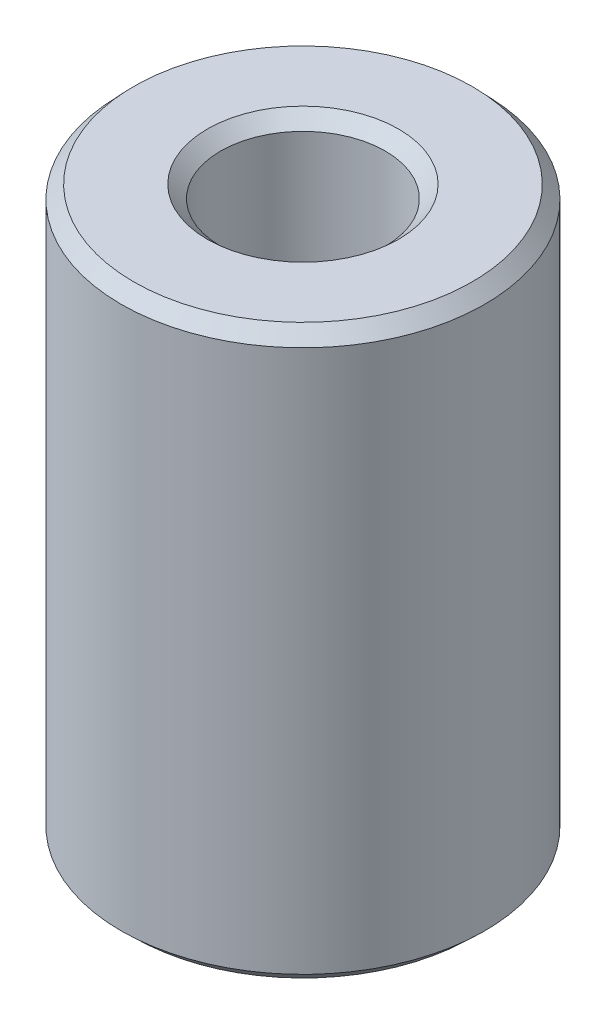
ISO-10303-21;
HEADER;
FILE_DESCRIPTION(('STEP AP214'),'2;1');
FILE_NAME('part.step','',(''),(''),'','','');
FILE_SCHEMA(('AUTOMOTIVE_DESIGN { 1 0 10303 214 1 1 1 1 }'));
ENDSEC;
DATA;
#1=APPLICATION_CONTEXT('core data for automotive mechanical design processes');
#2=APPLICATION_PROTOCOL_DEFINITION('international standard','automotive_design',2000,#1);
#3=PRODUCT_CONTEXT('',#1,'mechanical');
#4=PRODUCT('Part','Part','',(#3));
#5=PRODUCT_RELATED_PRODUCT_CATEGORY('part','',(#4));
#6=PRODUCT_DEFINITION_FORMATION('','',#4);
#7=PRODUCT_DEFINITION_CONTEXT('part definition',#1,'design');
#8=PRODUCT_DEFINITION('design','',#6,#7);
#9=PRODUCT_DEFINITION_SHAPE('','',#8);
#10=(LENGTH_UNIT() NAMED_UNIT(*) SI_UNIT(.MILLI.,.METRE.));
#11=(NAMED_UNIT(*) PLANE_ANGLE_UNIT() SI_UNIT($,.RADIAN.));
#12=(NAMED_UNIT(*) SI_UNIT($,.STERADIAN.) SOLID_ANGLE_UNIT());
#13=UNCERTAINTY_MEASURE_WITH_UNIT(LENGTH_MEASURE(1.E-05),#10,'distance_accuracy_value','');
#14=(GEOMETRIC_REPRESENTATION_CONTEXT(3) GLOBAL_UNCERTAINTY_ASSIGNED_CONTEXT((#13)) GLOBAL_UNIT_ASSIGNED_CONTEXT((#10,
#11,#12)) REPRESENTATION_CONTEXT('',''));
#15=CARTESIAN_POINT('',(0.,0.,0.));
#16=DIRECTION('',(0.,0.,1.));
#17=DIRECTION('',(1.,0.,0.));
#18=AXIS2_PLACEMENT_3D('',#15,#16,#17);
#19=CARTESIAN_POINT('',(0.,132.901870391606,0.));
#20=DIRECTION('',(0.,-1.,0.));
#21=DIRECTION('',(0.,0.,-1.));
#22=AXIS2_PLACEMENT_3D('',#19,#20,#21);
#23=CYLINDRICAL_SURFACE('',#22,42.5);
#24=CARTESIAN_POINT('',(0.,2.92153928185596,0.));
#25=DIRECTION('',(0.,1.,0.));
#26=DIRECTION('',(0.,0.,1.));
#27=AXIS2_PLACEMENT_3D('',#24,#25,#26);
#28=CIRCLE('',#27,42.5);
#29=CARTESIAN_POINT('',(0.,2.92153928185596,42.5));
#30=VERTEX_POINT('',#29);
#31=EDGE_CURVE('E10',#30,#30,#28,.T.);
#32=ORIENTED_EDGE('',*,*,#31,.T.);
#33=EDGE_LOOP('',(#32));
#34=FACE_BOUND('',#33,.T.);
#35=CARTESIAN_POINT('',(0.,129.81214978023,0.));
#36=DIRECTION('',(0.,1.,0.));
#37=DIRECTION('',(0.,0.,1.));
#38=AXIS2_PLACEMENT_3D('',#35,#36,#37);
#39=CIRCLE('',#38,42.5);
#40=CARTESIAN_POINT('',(0.,129.81214978023,42.5));
#41=VERTEX_POINT('',#40);
#42=EDGE_CURVE('E50',#41,#41,#39,.F.);
#43=ORIENTED_EDGE('',*,*,#42,.T.);
#44=EDGE_LOOP('',(#43));
#45=FACE_BOUND('',#44,.T.);
#46=ADVANCED_FACE('F39',(#34,#45),#23,.T.);
#47=CARTESIAN_POINT('',(0.,132.901870391606,0.));
#48=DIRECTION('',(0.,1.,0.));
#49=DIRECTION('',(0.,0.,1.));
#50=AXIS2_PLACEMENT_3D('',#47,#48,#49);
#51=PLANE('',#50);
#52=CARTESIAN_POINT('',(0.,132.901870391606,0.));
#53=DIRECTION('',(0.,1.,0.));
#54=DIRECTION('',(0.,0.,1.));
#55=AXIS2_PLACEMENT_3D('',#52,#53,#54);
#56=CIRCLE('',#55,22.3548011735052);
#57=CARTESIAN_POINT('',(0.,132.901870391606,22.3548011735052));
#58=VERTEX_POINT('',#57);
#59=EDGE_CURVE('E58',#58,#58,#56,.F.);
#60=ORIENTED_EDGE('',*,*,#59,.T.);
#61=EDGE_LOOP('',(#60));
#62=FACE_BOUND('',#61,.T.);
#63=CARTESIAN_POINT('',(0.,132.901870391606,0.));
#64=DIRECTION('',(0.,1.,0.));
#65=DIRECTION('',(0.,0.,1.));
#66=AXIS2_PLACEMENT_3D('',#63,#64,#65);
#67=CIRCLE('',#66,39.5784607181441);
#68=CARTESIAN_POINT('',(0.,132.901870391606,39.5784607181441));
#69=VERTEX_POINT('',#68);
#70=EDGE_CURVE('E61',#69,#69,#67,.T.);
#71=ORIENTED_EDGE('',*,*,#70,.T.);
#72=EDGE_LOOP('',(#71));
#73=FACE_BOUND('',#72,.T.);
#74=ADVANCED_FACE('F88',(#62,#73),#51,.T.);
#75=CARTESIAN_POINT('',(0.,0.,0.));
#76=DIRECTION('',(0.,1.,0.));
#77=DIRECTION('',(0.,0.,1.));
#78=AXIS2_PLACEMENT_3D('',#75,#76,#77);
#79=PLANE('',#78);
#80=CARTESIAN_POINT('',(0.,0.,0.));
#81=DIRECTION('',(0.,1.,0.));
#82=DIRECTION('',(0.,0.,1.));
#83=AXIS2_PLACEMENT_3D('',#80,#81,#82);
#84=CIRCLE('',#83,22.1866198439848);
#85=CARTESIAN_POINT('',(0.,0.,22.1866198439848));
#86=VERTEX_POINT('',#85);
#87=EDGE_CURVE('E51',#86,#86,#84,.T.);
#88=ORIENTED_EDGE('',*,*,#87,.T.);
#89=EDGE_LOOP('',(#88));
#90=FACE_BOUND('',#89,.T.);
#91=CARTESIAN_POINT('',(0.,0.,0.));
#92=DIRECTION('',(0.,1.,0.));
#93=DIRECTION('',(0.,0.,1.));
#94=AXIS2_PLACEMENT_3D('',#91,#92,#93);
#95=CIRCLE('',#94,39.4102793886236);
#96=CARTESIAN_POINT('',(0.,0.,39.4102793886236));
#97=VERTEX_POINT('',#96);
#98=EDGE_CURVE('E54',#97,#97,#95,.F.);
#99=ORIENTED_EDGE('',*,*,#98,.T.);
#100=EDGE_LOOP('',(#99));
#101=FACE_BOUND('',#100,.T.);
#102=ADVANCED_FACE('F83',(#90,#101),#79,.F.);
#103=CARTESIAN_POINT('',(0.,132.901870391606,0.));
#104=DIRECTION('',(0.,-1.,0.));
#105=DIRECTION('',(0.,0.,-1.));
#106=AXIS2_PLACEMENT_3D('',#103,#104,#105);
#107=CYLINDRICAL_SURFACE('',#106,19.2650805621289);
#108=CARTESIAN_POINT('',(0.,129.98033110975,0.));
#109=DIRECTION('',(0.,1.,0.));
#110=DIRECTION('',(0.,0.,1.));
#111=AXIS2_PLACEMENT_3D('',#108,#109,#110);
#112=CIRCLE('',#111,19.2650805621289);
#113=CARTESIAN_POINT('',(0.,129.98033110975,19.2650805621289));
#114=VERTEX_POINT('',#113);
#115=EDGE_CURVE('E67',#114,#114,#112,.T.);
#116=ORIENTED_EDGE('',*,*,#115,.T.);
#117=EDGE_LOOP('',(#116));
#118=FACE_BOUND('',#117,.T.);
#119=CARTESIAN_POINT('',(0.,3.08972061137636,0.));
#120=DIRECTION('',(0.,1.,0.));
#121=DIRECTION('',(0.,0.,1.));
#122=AXIS2_PLACEMENT_3D('',#119,#120,#121);
#123=CIRCLE('',#122,19.2650805621289);
#124=CARTESIAN_POINT('',(0.,3.08972061137636,19.2650805621289));
#125=VERTEX_POINT('',#124);
#126=EDGE_CURVE('E69',#125,#125,#123,.F.);
#127=ORIENTED_EDGE('',*,*,#126,.T.);
#128=EDGE_LOOP('',(#127));
#129=FACE_BOUND('',#128,.T.);
#130=ADVANCED_FACE('F71',(#118,#129),#107,.F.);
#131=CARTESIAN_POINT('',(0.,129.98033110975,0.));
#132=DIRECTION('',(0.,1.,0.));
#133=DIRECTION('',(0.,0.,1.));
#134=AXIS2_PLACEMENT_3D('',#131,#132,#133);
#135=CONICAL_SURFACE('',#134,19.2650805621289,0.813368584181631);
#136=ORIENTED_EDGE('',*,*,#59,.F.);
#137=EDGE_LOOP('',(#136));
#138=FACE_BOUND('',#137,.T.);
#139=ORIENTED_EDGE('',*,*,#115,.F.);
#140=EDGE_LOOP('',(#139));
#141=FACE_BOUND('',#140,.T.);
#142=ADVANCED_FACE('F77',(#138,#141),#135,.F.);
#143=CARTESIAN_POINT('',(0.,0.,0.));
#144=DIRECTION('',(0.,-1.,0.));
#145=DIRECTION('',(0.,0.,-1.));
#146=AXIS2_PLACEMENT_3D('',#143,#144,#145);
#147=CONICAL_SURFACE('',#146,22.1866198439848,0.757427742613264);
#148=ORIENTED_EDGE('',*,*,#126,.F.);
#149=EDGE_LOOP('',(#148));
#150=FACE_BOUND('',#149,.T.);
#151=ORIENTED_EDGE('',*,*,#87,.F.);
#152=EDGE_LOOP('',(#151));
#153=FACE_BOUND('',#152,.T.);
#154=ADVANCED_FACE('F73',(#150,#153),#147,.F.);
#155=CARTESIAN_POINT('',(0.,2.92153928185596,0.));
#156=DIRECTION('',(0.,1.,0.));
#157=DIRECTION('',(0.,0.,1.));
#158=AXIS2_PLACEMENT_3D('',#155,#156,#157);
#159=CONICAL_SURFACE('',#158,42.5,0.813368584181633);
#160=CARTESIAN_POINT('',(0.,0.,39.4102793886236));
#161=CARTESIAN_POINT('',(0.,0.0304327008526639,39.4424639783255));
#162=CARTESIAN_POINT('',(0.,0.0608654017053308,39.4746485680273));
#163=CARTESIAN_POINT('',(0.,0.121730803410664,39.539017747431));
#164=CARTESIAN_POINT('',(0.,0.152163504263331,39.5712023371328));
#165=CARTESIAN_POINT('',(0.,0.213028905968663,39.6355715165365));
#166=CARTESIAN_POINT('',(0.,0.243461606821329,39.6677561062383));
#167=CARTESIAN_POINT('',(0.,0.304327008526661,39.732125285642));
#168=CARTESIAN_POINT('',(0.,0.334759709379328,39.7643098753438));
#169=CARTESIAN_POINT('',(0.,0.395625111084661,39.8286790547475));
#170=CARTESIAN_POINT('',(0.,0.426057811937327,39.8608636444493));
#171=CARTESIAN_POINT('',(0.,0.486923213642659,39.925232823853));
#172=CARTESIAN_POINT('',(0.,0.517355914495324,39.9574174135549));
#173=CARTESIAN_POINT('',(0.,0.578221316200657,40.0217865929585));
#174=CARTESIAN_POINT('',(0.,0.608654017053324,40.0539711826604));
#175=CARTESIAN_POINT('',(0.,0.669519418758657,40.118340362064));
#176=CARTESIAN_POINT('',(0.,0.699952119611323,40.1505249517659));
#177=CARTESIAN_POINT('',(0.,0.760817521316654,40.2148941311696));
#178=CARTESIAN_POINT('',(0.,0.79125022216932,40.2470787208714));
#179=CARTESIAN_POINT('',(0.,0.852115623874653,40.3114479002751));
#180=CARTESIAN_POINT('',(0.,0.88254832472732,40.3436324899769));
#181=CARTESIAN_POINT('',(0.,0.943413726432653,40.4080016693806));
#182=CARTESIAN_POINT('',(0.,0.973846427285318,40.4401862590824));
#183=CARTESIAN_POINT('',(0.,1.03471182899065,40.5045554384861));
#184=CARTESIAN_POINT('',(0.,1.06514452984332,40.5367400281879));
#185=CARTESIAN_POINT('',(0.,1.12600993154865,40.6011092075916));
#186=CARTESIAN_POINT('',(0.,1.15644263240132,40.6332937972934));
#187=CARTESIAN_POINT('',(0.,1.21730803410665,40.6976629766971));
#188=CARTESIAN_POINT('',(0.,1.24774073495931,40.729847566399));
#189=CARTESIAN_POINT('',(0.,1.30860613666465,40.7942167458026));
#190=CARTESIAN_POINT('',(0.,1.33903883751731,40.8264013355045));
#191=CARTESIAN_POINT('',(0.,1.39990423922265,40.8907705149081));
#192=CARTESIAN_POINT('',(0.,1.43033694007531,40.92295510461));
#193=CARTESIAN_POINT('',(0.,1.49120234178064,40.9873242840137));
#194=CARTESIAN_POINT('',(0.,1.52163504263331,41.0195088737155));
#195=CARTESIAN_POINT('',(0.,1.58250044433864,41.0838780531192));
#196=CARTESIAN_POINT('',(0.,1.61293314519131,41.116062642821));
#197=CARTESIAN_POINT('',(0.,1.67379854689664,41.1804318222247));
#198=CARTESIAN_POINT('',(0.,1.70423124774931,41.2126164119265));
#199=CARTESIAN_POINT('',(0.,1.76509664945464,41.2769855913302));
#200=CARTESIAN_POINT('',(0.,1.79552935030731,41.309170181032));
#201=CARTESIAN_POINT('',(0.,1.85639475201264,41.3735393604357));
#202=CARTESIAN_POINT('',(0.,1.88682745286531,41.4057239501375));
#203=CARTESIAN_POINT('',(0.,1.94769285457064,41.4700931295412));
#204=CARTESIAN_POINT('',(0.,1.9781255554233,41.5022777192431));
#205=CARTESIAN_POINT('',(0.,2.03899095712864,41.5666468986467));
#206=CARTESIAN_POINT('',(0.,2.0694236579813,41.5988314883486));
#207=CARTESIAN_POINT('',(0.,2.13028905968664,41.6632006677522));
#208=CARTESIAN_POINT('',(0.,2.1607217605393,41.6953852574541));
#209=CARTESIAN_POINT('',(0.,2.22158716224463,41.7597544368578));
#210=CARTESIAN_POINT('',(0.,2.2520198630973,41.7919390265596));
#211=CARTESIAN_POINT('',(0.,2.31288526480263,41.8563082059633));
#212=CARTESIAN_POINT('',(0.,2.3433179656553,41.8884927956651));
#213=CARTESIAN_POINT('',(0.,2.40418336736063,41.9528619750688));
#214=CARTESIAN_POINT('',(0.,2.4346160682133,41.9850465647706));
#215=CARTESIAN_POINT('',(0.,2.49548146991863,42.0494157441743));
#216=CARTESIAN_POINT('',(0.,2.52591417077129,42.0816003338761));
#217=CARTESIAN_POINT('',(0.,2.58677957247663,42.1459695132798));
#218=CARTESIAN_POINT('',(0.,2.61721227332929,42.1781541029816));
#219=CARTESIAN_POINT('',(0.,2.67807767503463,42.2425232823853));
#220=CARTESIAN_POINT('',(0.,2.70851037588729,42.2747078720871));
#221=CARTESIAN_POINT('',(0.,2.76937577759262,42.3390770514908));
#222=CARTESIAN_POINT('',(0.,2.79980847844529,42.3712616411927));
#223=CARTESIAN_POINT('',(0.,2.86067388015063,42.4356308205963));
#224=CARTESIAN_POINT('',(0.,2.89110658100329,42.4678154102982));
#225=CARTESIAN_POINT('',(0.,2.92153928185596,42.5));
#226=B_SPLINE_CURVE_WITH_KNOTS('',3,(#160,#161,#162,#163,#164,#165,#166,#167,#168,#169,#170,
#171,#172,#173,#174,#175,#176,#177,#178,#179,#180,#181,#182,#183,#184,#185,#186,#187,#188,#189,
#190,#191,#192,#193,#194,#195,#196,#197,#198,#199,#200,#201,#202,#203,#204,#205,#206,#207,#208,
#209,#210,#211,#212,#213,#214,#215,#216,#217,#218,#219,#220,#221,#222,#223,#224,#225),
.UNSPECIFIED.,.F.,.F.,(4,2,2,2,2,2,2,2,2,2,2,2,2,2,2,2,2,2,2,2,2,2,2,2,2,2,2,2,2,2,2,2,4),(0.,
0.132883309182048,0.265766618364092,0.39864992754614,0.531533236728183,0.664416545910232,
0.79729985509228,0.930183164274324,1.06306647345637,1.19594978263842,1.32883309182046,
1.46171640100251,1.59459971018456,1.7274830193666,1.86036632854865,1.9932496377307,
2.12613294691274,2.25901625609479,2.39189956527684,2.52478287445888,2.65766618364093,
2.79054949282297,2.92343280200502,3.05631611118707,3.18919942036911,3.32208272955116,
3.45496603873321,3.58784934791526,3.7207326570973,3.85361596627935,3.9864992754614,
4.11938258464344,4.25226589382549),.UNSPECIFIED.);
#227=EDGE_CURVE('BSEAM76',#97,#30,#226,.T.);
#228=ORIENTED_EDGE('',*,*,#98,.F.);
#229=ORIENTED_EDGE('',*,*,#31,.F.);
#230=ORIENTED_EDGE('',*,*,#227,.T.);
#231=ORIENTED_EDGE('',*,*,#227,.F.);
#232=EDGE_LOOP('',(#228,#230,#229,#231));
#233=FACE_BOUND('',#232,.T.);
#234=ADVANCED_FACE('F76',(#233),#159,.T.);
#235=CARTESIAN_POINT('',(0.,132.901870391606,0.));
#236=DIRECTION('',(0.,-1.,0.));
#237=DIRECTION('',(0.,0.,-1.));
#238=AXIS2_PLACEMENT_3D('',#235,#236,#237);
#239=CONICAL_SURFACE('',#238,39.5784607181441,0.757427742613264);
#240=ORIENTED_EDGE('',*,*,#42,.F.);
#241=EDGE_LOOP('',(#240));
#242=FACE_BOUND('',#241,.T.);
#243=ORIENTED_EDGE('',*,*,#70,.F.);
#244=EDGE_LOOP('',(#243));
#245=FACE_BOUND('',#244,.T.);
#246=ADVANCED_FACE('F45',(#242,#245),#239,.T.);
#247=CLOSED_SHELL('',(#46,#74,#102,#130,#142,#154,#234,#246));
#248=MANIFOLD_SOLID_BREP('B2',#247);
#249=ADVANCED_BREP_SHAPE_REPRESENTATION('',(#18,#248),#14);
#250=SHAPE_DEFINITION_REPRESENTATION(#9,#249);
ENDSEC;
END-ISO-10303-21;
